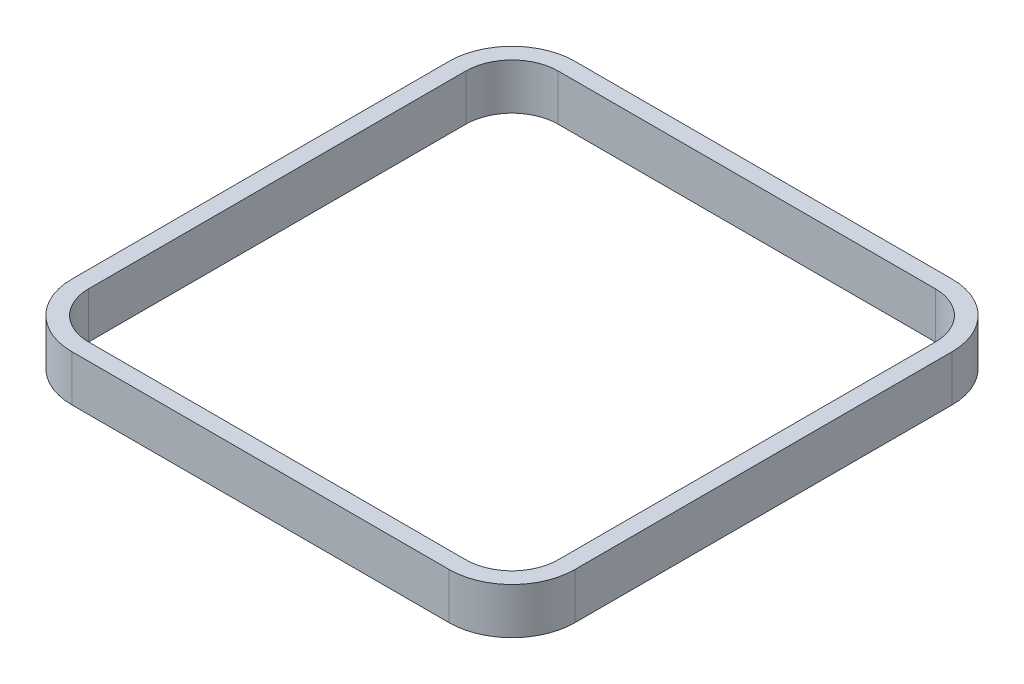
ISO-10303-21;
HEADER;
FILE_DESCRIPTION(('STEP AP214'),'2;1');
FILE_NAME('part.step','',(''),(''),'','','');
FILE_SCHEMA(('AUTOMOTIVE_DESIGN { 1 0 10303 214 1 1 1 1 }'));
ENDSEC;
DATA;
#1=APPLICATION_CONTEXT('core data for automotive mechanical design processes');
#2=APPLICATION_PROTOCOL_DEFINITION('international standard','automotive_design',2000,#1);
#3=PRODUCT_CONTEXT('',#1,'mechanical');
#4=PRODUCT('Part','Part','',(#3));
#5=PRODUCT_RELATED_PRODUCT_CATEGORY('part','',(#4));
#6=PRODUCT_DEFINITION_FORMATION('','',#4);
#7=PRODUCT_DEFINITION_CONTEXT('part definition',#1,'design');
#8=PRODUCT_DEFINITION('design','',#6,#7);
#9=PRODUCT_DEFINITION_SHAPE('','',#8);
#10=(LENGTH_UNIT() NAMED_UNIT(*) SI_UNIT(.MILLI.,.METRE.));
#11=(NAMED_UNIT(*) PLANE_ANGLE_UNIT() SI_UNIT($,.RADIAN.));
#12=(NAMED_UNIT(*) SI_UNIT($,.STERADIAN.) SOLID_ANGLE_UNIT());
#13=UNCERTAINTY_MEASURE_WITH_UNIT(LENGTH_MEASURE(1.E-05),#10,'distance_accuracy_value','');
#14=(GEOMETRIC_REPRESENTATION_CONTEXT(3) GLOBAL_UNCERTAINTY_ASSIGNED_CONTEXT((#13)) GLOBAL_UNIT_ASSIGNED_CONTEXT((#10,
#11,#12)) REPRESENTATION_CONTEXT('',''));
#15=CARTESIAN_POINT('',(0.,0.,0.));
#16=DIRECTION('',(0.,0.,1.));
#17=DIRECTION('',(1.,0.,0.));
#18=AXIS2_PLACEMENT_3D('',#15,#16,#17);
#19=CARTESIAN_POINT('',(450.,150.,-450.));
#20=DIRECTION('',(0.,-1.,0.));
#21=DIRECTION('',(0.,0.,-1.));
#22=AXIS2_PLACEMENT_3D('',#19,#20,#21);
#23=CYLINDRICAL_SURFACE('',#22,150.);
#24=CARTESIAN_POINT('',(450.,40.,-450.));
#25=DIRECTION('',(0.,-1.,0.));
#26=DIRECTION('',(0.,0.,-1.));
#27=AXIS2_PLACEMENT_3D('',#24,#25,#26);
#28=CIRCLE('',#27,150.);
#29=CARTESIAN_POINT('',(449.999999999999,40.,-600.));
#30=VERTEX_POINT('',#29);
#31=CARTESIAN_POINT('',(600.,40.,-449.999999999999));
#32=VERTEX_POINT('',#31);
#33=EDGE_CURVE('E51',#30,#32,#28,.T.);
#34=ORIENTED_EDGE('',*,*,#33,.F.);
#35=DIRECTION('',(0.,-1.,0.));
#36=VECTOR('',#35,1.);
#37=CARTESIAN_POINT('',(449.999999999999,150.,-600.));
#38=LINE('',#37,#36);
#39=CARTESIAN_POINT('',(449.999999999999,150.,-600.));
#40=VERTEX_POINT('',#39);
#41=EDGE_CURVE('E11',#40,#30,#38,.T.);
#42=ORIENTED_EDGE('',*,*,#41,.F.);
#43=CARTESIAN_POINT('',(450.,150.,-450.));
#44=DIRECTION('',(0.,1.,0.));
#45=DIRECTION('',(0.,0.,-1.));
#46=AXIS2_PLACEMENT_3D('',#43,#44,#45);
#47=CIRCLE('',#46,150.);
#48=CARTESIAN_POINT('',(600.,150.,-449.999999999999));
#49=VERTEX_POINT('',#48);
#50=EDGE_CURVE('E278',#49,#40,#47,.T.);
#51=ORIENTED_EDGE('',*,*,#50,.F.);
#52=DIRECTION('',(0.,-1.,0.));
#53=VECTOR('',#52,1.);
#54=CARTESIAN_POINT('',(600.,150.,-449.999999999999));
#55=LINE('',#54,#53);
#56=EDGE_CURVE('E174',#49,#32,#55,.T.);
#57=ORIENTED_EDGE('',*,*,#56,.T.);
#58=EDGE_LOOP('',(#34,#42,#51,#57));
#59=FACE_BOUND('',#58,.T.);
#60=ADVANCED_FACE('F36',(#59),#23,.T.);
#61=CARTESIAN_POINT('',(-449.999999999999,150.,-600.));
#62=DIRECTION('',(0.,0.,1.));
#63=DIRECTION('',(1.,0.,0.));
#64=AXIS2_PLACEMENT_3D('',#61,#62,#63);
#65=PLANE('',#64);
#66=DIRECTION('',(1.,0.,0.));
#67=VECTOR('',#66,1.);
#68=CARTESIAN_POINT('',(-449.999999999999,40.,-600.));
#69=LINE('',#68,#67);
#70=CARTESIAN_POINT('',(-449.999999999999,40.,-600.));
#71=VERTEX_POINT('',#70);
#72=EDGE_CURVE('E212',#71,#30,#69,.T.);
#73=ORIENTED_EDGE('',*,*,#72,.F.);
#74=DIRECTION('',(0.,-1.,0.));
#75=VECTOR('',#74,1.);
#76=CARTESIAN_POINT('',(-449.999999999999,150.,-600.));
#77=LINE('',#76,#75);
#78=CARTESIAN_POINT('',(-449.999999999999,150.,-600.));
#79=VERTEX_POINT('',#78);
#80=EDGE_CURVE('E44',#79,#71,#77,.T.);
#81=ORIENTED_EDGE('',*,*,#80,.F.);
#82=DIRECTION('',(-1.,0.,0.));
#83=VECTOR('',#82,1.);
#84=CARTESIAN_POINT('',(-449.999999999999,150.,-600.));
#85=LINE('',#84,#83);
#86=EDGE_CURVE('E210',#40,#79,#85,.T.);
#87=ORIENTED_EDGE('',*,*,#86,.F.);
#88=ORIENTED_EDGE('',*,*,#41,.T.);
#89=EDGE_LOOP('',(#73,#81,#87,#88));
#90=FACE_BOUND('',#89,.T.);
#91=ADVANCED_FACE('F209',(#90),#65,.F.);
#92=CARTESIAN_POINT('',(-450.,150.,-450.));
#93=DIRECTION('',(0.,-1.,0.));
#94=DIRECTION('',(0.,0.,-1.));
#95=AXIS2_PLACEMENT_3D('',#92,#93,#94);
#96=CYLINDRICAL_SURFACE('',#95,150.);
#97=CARTESIAN_POINT('',(-450.,40.,-450.));
#98=DIRECTION('',(0.,-1.,0.));
#99=DIRECTION('',(0.,0.,-1.));
#100=AXIS2_PLACEMENT_3D('',#97,#98,#99);
#101=CIRCLE('',#100,150.);
#102=CARTESIAN_POINT('',(-600.,40.,-449.999999999999));
#103=VERTEX_POINT('',#102);
#104=EDGE_CURVE('E205',#103,#71,#101,.T.);
#105=ORIENTED_EDGE('',*,*,#104,.F.);
#106=DIRECTION('',(0.,-1.,0.));
#107=VECTOR('',#106,1.);
#108=CARTESIAN_POINT('',(-600.,150.,-449.999999999999));
#109=LINE('',#108,#107);
#110=CARTESIAN_POINT('',(-600.,150.,-449.999999999999));
#111=VERTEX_POINT('',#110);
#112=EDGE_CURVE('E192',#111,#103,#109,.T.);
#113=ORIENTED_EDGE('',*,*,#112,.F.);
#114=CARTESIAN_POINT('',(-450.,150.,-450.));
#115=DIRECTION('',(0.,1.,0.));
#116=DIRECTION('',(0.,0.,-1.));
#117=AXIS2_PLACEMENT_3D('',#114,#115,#116);
#118=CIRCLE('',#117,150.);
#119=EDGE_CURVE('E206',#79,#111,#118,.T.);
#120=ORIENTED_EDGE('',*,*,#119,.F.);
#121=ORIENTED_EDGE('',*,*,#80,.T.);
#122=EDGE_LOOP('',(#105,#113,#120,#121));
#123=FACE_BOUND('',#122,.T.);
#124=ADVANCED_FACE('F203',(#123),#96,.T.);
#125=CARTESIAN_POINT('',(-600.,150.,449.999999999999));
#126=DIRECTION('',(1.,0.,0.));
#127=DIRECTION('',(0.,0.,-1.));
#128=AXIS2_PLACEMENT_3D('',#125,#126,#127);
#129=PLANE('',#128);
#130=DIRECTION('',(0.,0.,-1.));
#131=VECTOR('',#130,1.);
#132=CARTESIAN_POINT('',(-600.,40.,449.999999999999));
#133=LINE('',#132,#131);
#134=CARTESIAN_POINT('',(-600.,40.,449.999999999999));
#135=VERTEX_POINT('',#134);
#136=EDGE_CURVE('E221',#135,#103,#133,.T.);
#137=ORIENTED_EDGE('',*,*,#136,.F.);
#138=DIRECTION('',(0.,-1.,0.));
#139=VECTOR('',#138,1.);
#140=CARTESIAN_POINT('',(-600.,150.,449.999999999999));
#141=LINE('',#140,#139);
#142=CARTESIAN_POINT('',(-600.,150.,449.999999999999));
#143=VERTEX_POINT('',#142);
#144=EDGE_CURVE('E188',#143,#135,#141,.T.);
#145=ORIENTED_EDGE('',*,*,#144,.F.);
#146=DIRECTION('',(0.,0.,1.));
#147=VECTOR('',#146,1.);
#148=CARTESIAN_POINT('',(-600.,150.,449.999999999999));
#149=LINE('',#148,#147);
#150=EDGE_CURVE('E304',#111,#143,#149,.T.);
#151=ORIENTED_EDGE('',*,*,#150,.F.);
#152=ORIENTED_EDGE('',*,*,#112,.T.);
#153=EDGE_LOOP('',(#137,#145,#151,#152));
#154=FACE_BOUND('',#153,.T.);
#155=ADVANCED_FACE('F330',(#154),#129,.F.);
#156=CARTESIAN_POINT('',(-450.,150.,450.));
#157=DIRECTION('',(0.,-1.,0.));
#158=DIRECTION('',(0.,0.,-1.));
#159=AXIS2_PLACEMENT_3D('',#156,#157,#158);
#160=CYLINDRICAL_SURFACE('',#159,150.);
#161=CARTESIAN_POINT('',(-450.,40.,450.));
#162=DIRECTION('',(0.,-1.,0.));
#163=DIRECTION('',(0.,0.,-1.));
#164=AXIS2_PLACEMENT_3D('',#161,#162,#163);
#165=CIRCLE('',#164,150.);
#166=CARTESIAN_POINT('',(-449.999999999999,40.,600.));
#167=VERTEX_POINT('',#166);
#168=EDGE_CURVE('E323',#167,#135,#165,.T.);
#169=ORIENTED_EDGE('',*,*,#168,.F.);
#170=DIRECTION('',(0.,-1.,0.));
#171=VECTOR('',#170,1.);
#172=CARTESIAN_POINT('',(-449.999999999999,150.,600.));
#173=LINE('',#172,#171);
#174=CARTESIAN_POINT('',(-449.999999999999,150.,600.));
#175=VERTEX_POINT('',#174);
#176=EDGE_CURVE('E179',#175,#167,#173,.T.);
#177=ORIENTED_EDGE('',*,*,#176,.F.);
#178=CARTESIAN_POINT('',(-450.,150.,450.));
#179=DIRECTION('',(0.,1.,0.));
#180=DIRECTION('',(0.,0.,-1.));
#181=AXIS2_PLACEMENT_3D('',#178,#179,#180);
#182=CIRCLE('',#181,150.);
#183=EDGE_CURVE('E307',#143,#175,#182,.T.);
#184=ORIENTED_EDGE('',*,*,#183,.F.);
#185=ORIENTED_EDGE('',*,*,#144,.T.);
#186=EDGE_LOOP('',(#169,#177,#184,#185));
#187=FACE_BOUND('',#186,.T.);
#188=ADVANCED_FACE('F334',(#187),#160,.T.);
#189=CARTESIAN_POINT('',(-449.999999999999,150.,600.));
#190=DIRECTION('',(0.,0.,-1.));
#191=DIRECTION('',(-1.,0.,0.));
#192=AXIS2_PLACEMENT_3D('',#189,#190,#191);
#193=PLANE('',#192);
#194=DIRECTION('',(-1.,0.,0.));
#195=VECTOR('',#194,1.);
#196=CARTESIAN_POINT('',(449.999999999999,40.,600.));
#197=LINE('',#196,#195);
#198=CARTESIAN_POINT('',(449.999999999999,40.,600.));
#199=VERTEX_POINT('',#198);
#200=EDGE_CURVE('E169',#199,#167,#197,.T.);
#201=ORIENTED_EDGE('',*,*,#200,.F.);
#202=DIRECTION('',(0.,-1.,0.));
#203=VECTOR('',#202,1.);
#204=CARTESIAN_POINT('',(449.999999999999,150.,600.));
#205=LINE('',#204,#203);
#206=CARTESIAN_POINT('',(449.999999999999,150.,600.));
#207=VERTEX_POINT('',#206);
#208=EDGE_CURVE('E167',#207,#199,#205,.T.);
#209=ORIENTED_EDGE('',*,*,#208,.F.);
#210=DIRECTION('',(1.,0.,0.));
#211=VECTOR('',#210,1.);
#212=CARTESIAN_POINT('',(-449.999999999999,150.,600.));
#213=LINE('',#212,#211);
#214=EDGE_CURVE('E310',#175,#207,#213,.T.);
#215=ORIENTED_EDGE('',*,*,#214,.F.);
#216=ORIENTED_EDGE('',*,*,#176,.T.);
#217=EDGE_LOOP('',(#201,#209,#215,#216));
#218=FACE_BOUND('',#217,.T.);
#219=ADVANCED_FACE('F338',(#218),#193,.F.);
#220=CARTESIAN_POINT('',(450.,150.,450.));
#221=DIRECTION('',(0.,-1.,0.));
#222=DIRECTION('',(0.,0.,-1.));
#223=AXIS2_PLACEMENT_3D('',#220,#221,#222);
#224=CYLINDRICAL_SURFACE('',#223,150.);
#225=CARTESIAN_POINT('',(450.,40.,450.));
#226=DIRECTION('',(0.,-1.,0.));
#227=DIRECTION('',(0.,0.,-1.));
#228=AXIS2_PLACEMENT_3D('',#225,#226,#227);
#229=CIRCLE('',#228,150.);
#230=CARTESIAN_POINT('',(600.,40.,449.999999999999));
#231=VERTEX_POINT('',#230);
#232=EDGE_CURVE('E151',#231,#199,#229,.T.);
#233=ORIENTED_EDGE('',*,*,#232,.F.);
#234=DIRECTION('',(0.,-1.,0.));
#235=VECTOR('',#234,1.);
#236=CARTESIAN_POINT('',(600.,150.,449.999999999999));
#237=LINE('',#236,#235);
#238=CARTESIAN_POINT('',(600.,150.,449.999999999999));
#239=VERTEX_POINT('',#238);
#240=EDGE_CURVE('E164',#239,#231,#237,.T.);
#241=ORIENTED_EDGE('',*,*,#240,.F.);
#242=CARTESIAN_POINT('',(450.,150.,450.));
#243=DIRECTION('',(0.,1.,0.));
#244=DIRECTION('',(0.,0.,-1.));
#245=AXIS2_PLACEMENT_3D('',#242,#243,#244);
#246=CIRCLE('',#245,150.);
#247=EDGE_CURVE('E312',#207,#239,#246,.T.);
#248=ORIENTED_EDGE('',*,*,#247,.F.);
#249=ORIENTED_EDGE('',*,*,#208,.T.);
#250=EDGE_LOOP('',(#233,#241,#248,#249));
#251=FACE_BOUND('',#250,.T.);
#252=ADVANCED_FACE('F162',(#251),#224,.T.);
#253=CARTESIAN_POINT('',(600.,150.,449.999999999999));
#254=DIRECTION('',(-1.,0.,0.));
#255=DIRECTION('',(0.,0.,1.));
#256=AXIS2_PLACEMENT_3D('',#253,#254,#255);
#257=PLANE('',#256);
#258=DIRECTION('',(0.,0.,1.));
#259=VECTOR('',#258,1.);
#260=CARTESIAN_POINT('',(600.,40.,-449.999999999999));
#261=LINE('',#260,#259);
#262=EDGE_CURVE('E147',#32,#231,#261,.T.);
#263=ORIENTED_EDGE('',*,*,#262,.F.);
#264=ORIENTED_EDGE('',*,*,#56,.F.);
#265=DIRECTION('',(0.,0.,-1.));
#266=VECTOR('',#265,1.);
#267=CARTESIAN_POINT('',(600.,150.,449.999999999999));
#268=LINE('',#267,#266);
#269=EDGE_CURVE('E172',#239,#49,#268,.T.);
#270=ORIENTED_EDGE('',*,*,#269,.F.);
#271=ORIENTED_EDGE('',*,*,#240,.T.);
#272=EDGE_LOOP('',(#263,#264,#270,#271));
#273=FACE_BOUND('',#272,.T.);
#274=ADVANCED_FACE('F171',(#273),#257,.F.);
#275=CARTESIAN_POINT('',(450.,150.,-450.));
#276=DIRECTION('',(0.,-1.,0.));
#277=DIRECTION('',(0.,0.,-1.));
#278=AXIS2_PLACEMENT_3D('',#275,#276,#277);
#279=PLANE('',#278);
#280=DIRECTION('',(-1.,0.,0.));
#281=VECTOR('',#280,1.);
#282=CARTESIAN_POINT('',(449.999999999999,150.,-560.));
#283=LINE('',#282,#281);
#284=CARTESIAN_POINT('',(449.999999999999,150.,-560.));
#285=VERTEX_POINT('',#284);
#286=CARTESIAN_POINT('',(-449.999999999999,150.,-560.));
#287=VERTEX_POINT('',#286);
#288=EDGE_CURVE('E219',#285,#287,#283,.T.);
#289=ORIENTED_EDGE('',*,*,#288,.F.);
#290=CARTESIAN_POINT('',(450.,150.,-450.));
#291=DIRECTION('',(0.,1.,0.));
#292=DIRECTION('',(0.,0.,1.));
#293=AXIS2_PLACEMENT_3D('',#290,#291,#292);
#294=CIRCLE('',#293,110.);
#295=CARTESIAN_POINT('',(560.,150.,-449.999999999999));
#296=VERTEX_POINT('',#295);
#297=EDGE_CURVE('E59',#296,#285,#294,.T.);
#298=ORIENTED_EDGE('',*,*,#297,.F.);
#299=DIRECTION('',(0.,0.,-1.));
#300=VECTOR('',#299,1.);
#301=CARTESIAN_POINT('',(560.,150.,449.999999999999));
#302=LINE('',#301,#300);
#303=CARTESIAN_POINT('',(560.,150.,449.999999999999));
#304=VERTEX_POINT('',#303);
#305=EDGE_CURVE('E229',#304,#296,#302,.T.);
#306=ORIENTED_EDGE('',*,*,#305,.F.);
#307=CARTESIAN_POINT('',(450.,150.,450.));
#308=DIRECTION('',(0.,1.,0.));
#309=DIRECTION('',(0.,0.,1.));
#310=AXIS2_PLACEMENT_3D('',#307,#308,#309);
#311=CIRCLE('',#310,110.);
#312=CARTESIAN_POINT('',(449.999999999999,150.,560.));
#313=VERTEX_POINT('',#312);
#314=EDGE_CURVE('E268',#313,#304,#311,.T.);
#315=ORIENTED_EDGE('',*,*,#314,.F.);
#316=DIRECTION('',(1.,0.,0.));
#317=VECTOR('',#316,1.);
#318=CARTESIAN_POINT('',(-449.999999999999,150.,560.));
#319=LINE('',#318,#317);
#320=CARTESIAN_POINT('',(-449.999999999999,150.,560.));
#321=VERTEX_POINT('',#320);
#322=EDGE_CURVE('E264',#321,#313,#319,.T.);
#323=ORIENTED_EDGE('',*,*,#322,.F.);
#324=CARTESIAN_POINT('',(-450.,150.,450.));
#325=DIRECTION('',(0.,1.,0.));
#326=DIRECTION('',(0.,0.,1.));
#327=AXIS2_PLACEMENT_3D('',#324,#325,#326);
#328=CIRCLE('',#327,110.);
#329=CARTESIAN_POINT('',(-560.,150.,449.999999999999));
#330=VERTEX_POINT('',#329);
#331=EDGE_CURVE('E261',#330,#321,#328,.T.);
#332=ORIENTED_EDGE('',*,*,#331,.F.);
#333=DIRECTION('',(0.,0.,1.));
#334=VECTOR('',#333,1.);
#335=CARTESIAN_POINT('',(-560.,150.,-449.999999999999));
#336=LINE('',#335,#334);
#337=CARTESIAN_POINT('',(-560.,150.,-449.999999999999));
#338=VERTEX_POINT('',#337);
#339=EDGE_CURVE('E257',#338,#330,#336,.T.);
#340=ORIENTED_EDGE('',*,*,#339,.F.);
#341=CARTESIAN_POINT('',(-450.,150.,-450.));
#342=DIRECTION('',(0.,1.,0.));
#343=DIRECTION('',(0.,0.,1.));
#344=AXIS2_PLACEMENT_3D('',#341,#342,#343);
#345=CIRCLE('',#344,110.);
#346=EDGE_CURVE('E253',#287,#338,#345,.T.);
#347=ORIENTED_EDGE('',*,*,#346,.F.);
#348=EDGE_LOOP('',(#289,#298,#306,#315,#323,#332,#340,#347));
#349=FACE_BOUND('',#348,.T.);
#350=ORIENTED_EDGE('',*,*,#50,.T.);
#351=ORIENTED_EDGE('',*,*,#86,.T.);
#352=ORIENTED_EDGE('',*,*,#119,.T.);
#353=ORIENTED_EDGE('',*,*,#150,.T.);
#354=ORIENTED_EDGE('',*,*,#183,.T.);
#355=ORIENTED_EDGE('',*,*,#214,.T.);
#356=ORIENTED_EDGE('',*,*,#247,.T.);
#357=ORIENTED_EDGE('',*,*,#269,.T.);
#358=EDGE_LOOP('',(#350,#351,#352,#353,#354,#355,#356,#357));
#359=FACE_BOUND('',#358,.T.);
#360=ADVANCED_FACE('F315',(#349,#359),#279,.F.);
#361=CARTESIAN_POINT('',(450.,40.,-450.));
#362=DIRECTION('',(0.,1.,0.));
#363=DIRECTION('',(0.,0.,1.));
#364=AXIS2_PLACEMENT_3D('',#361,#362,#363);
#365=CYLINDRICAL_SURFACE('',#364,110.);
#366=ORIENTED_EDGE('',*,*,#297,.T.);
#367=DIRECTION('',(0.,1.,0.));
#368=VECTOR('',#367,1.);
#369=CARTESIAN_POINT('',(449.999999999999,40.,-560.));
#370=LINE('',#369,#368);
#371=CARTESIAN_POINT('',(449.999999999999,40.,-560.));
#372=VERTEX_POINT('',#371);
#373=EDGE_CURVE('E248',#372,#285,#370,.T.);
#374=ORIENTED_EDGE('',*,*,#373,.F.);
#375=CARTESIAN_POINT('',(450.,40.,-450.));
#376=DIRECTION('',(0.,1.,0.));
#377=DIRECTION('',(0.,0.,1.));
#378=AXIS2_PLACEMENT_3D('',#375,#376,#377);
#379=CIRCLE('',#378,110.);
#380=CARTESIAN_POINT('',(560.,40.,-449.999999999999));
#381=VERTEX_POINT('',#380);
#382=EDGE_CURVE('E225',#381,#372,#379,.T.);
#383=ORIENTED_EDGE('',*,*,#382,.F.);
#384=DIRECTION('',(0.,1.,0.));
#385=VECTOR('',#384,1.);
#386=CARTESIAN_POINT('',(560.,40.,-449.999999999999));
#387=LINE('',#386,#385);
#388=EDGE_CURVE('E275',#381,#296,#387,.T.);
#389=ORIENTED_EDGE('',*,*,#388,.T.);
#390=EDGE_LOOP('',(#366,#374,#383,#389));
#391=FACE_BOUND('',#390,.T.);
#392=ADVANCED_FACE('F387',(#391),#365,.F.);
#393=CARTESIAN_POINT('',(560.,40.,449.999999999999));
#394=DIRECTION('',(1.,0.,0.));
#395=DIRECTION('',(0.,0.,-1.));
#396=AXIS2_PLACEMENT_3D('',#393,#394,#395);
#397=PLANE('',#396);
#398=ORIENTED_EDGE('',*,*,#305,.T.);
#399=ORIENTED_EDGE('',*,*,#388,.F.);
#400=DIRECTION('',(0.,0.,-1.));
#401=VECTOR('',#400,1.);
#402=CARTESIAN_POINT('',(560.,40.,449.999999999999));
#403=LINE('',#402,#401);
#404=CARTESIAN_POINT('',(560.,40.,449.999999999999));
#405=VERTEX_POINT('',#404);
#406=EDGE_CURVE('E246',#405,#381,#403,.T.);
#407=ORIENTED_EDGE('',*,*,#406,.F.);
#408=DIRECTION('',(0.,1.,0.));
#409=VECTOR('',#408,1.);
#410=CARTESIAN_POINT('',(560.,40.,449.999999999999));
#411=LINE('',#410,#409);
#412=EDGE_CURVE('E279',#405,#304,#411,.T.);
#413=ORIENTED_EDGE('',*,*,#412,.T.);
#414=EDGE_LOOP('',(#398,#399,#407,#413));
#415=FACE_BOUND('',#414,.T.);
#416=ADVANCED_FACE('F396',(#415),#397,.F.);
#417=CARTESIAN_POINT('',(450.,40.,450.));
#418=DIRECTION('',(0.,1.,0.));
#419=DIRECTION('',(0.,0.,1.));
#420=AXIS2_PLACEMENT_3D('',#417,#418,#419);
#421=CYLINDRICAL_SURFACE('',#420,110.);
#422=ORIENTED_EDGE('',*,*,#314,.T.);
#423=ORIENTED_EDGE('',*,*,#412,.F.);
#424=CARTESIAN_POINT('',(450.,40.,450.));
#425=DIRECTION('',(0.,1.,0.));
#426=DIRECTION('',(0.,0.,1.));
#427=AXIS2_PLACEMENT_3D('',#424,#425,#426);
#428=CIRCLE('',#427,110.);
#429=CARTESIAN_POINT('',(449.999999999999,40.,560.));
#430=VERTEX_POINT('',#429);
#431=EDGE_CURVE('E244',#430,#405,#428,.T.);
#432=ORIENTED_EDGE('',*,*,#431,.F.);
#433=DIRECTION('',(0.,1.,0.));
#434=VECTOR('',#433,1.);
#435=CARTESIAN_POINT('',(449.999999999999,40.,560.));
#436=LINE('',#435,#434);
#437=EDGE_CURVE('E282',#430,#313,#436,.T.);
#438=ORIENTED_EDGE('',*,*,#437,.T.);
#439=EDGE_LOOP('',(#422,#423,#432,#438));
#440=FACE_BOUND('',#439,.T.);
#441=ADVANCED_FACE('F404',(#440),#421,.F.);
#442=CARTESIAN_POINT('',(-449.999999999999,40.,560.));
#443=DIRECTION('',(0.,0.,1.));
#444=DIRECTION('',(1.,0.,0.));
#445=AXIS2_PLACEMENT_3D('',#442,#443,#444);
#446=PLANE('',#445);
#447=ORIENTED_EDGE('',*,*,#322,.T.);
#448=ORIENTED_EDGE('',*,*,#437,.F.);
#449=DIRECTION('',(1.,0.,0.));
#450=VECTOR('',#449,1.);
#451=CARTESIAN_POINT('',(-449.999999999999,40.,560.));
#452=LINE('',#451,#450);
#453=CARTESIAN_POINT('',(-449.999999999999,40.,560.));
#454=VERTEX_POINT('',#453);
#455=EDGE_CURVE('E241',#454,#430,#452,.T.);
#456=ORIENTED_EDGE('',*,*,#455,.F.);
#457=DIRECTION('',(0.,1.,0.));
#458=VECTOR('',#457,1.);
#459=CARTESIAN_POINT('',(-449.999999999999,40.,560.));
#460=LINE('',#459,#458);
#461=EDGE_CURVE('E285',#454,#321,#460,.T.);
#462=ORIENTED_EDGE('',*,*,#461,.T.);
#463=EDGE_LOOP('',(#447,#448,#456,#462));
#464=FACE_BOUND('',#463,.T.);
#465=ADVANCED_FACE('F413',(#464),#446,.F.);
#466=CARTESIAN_POINT('',(-450.,40.,450.));
#467=DIRECTION('',(0.,1.,0.));
#468=DIRECTION('',(0.,0.,1.));
#469=AXIS2_PLACEMENT_3D('',#466,#467,#468);
#470=CYLINDRICAL_SURFACE('',#469,110.);
#471=ORIENTED_EDGE('',*,*,#331,.T.);
#472=ORIENTED_EDGE('',*,*,#461,.F.);
#473=CARTESIAN_POINT('',(-450.,40.,450.));
#474=DIRECTION('',(0.,1.,0.));
#475=DIRECTION('',(0.,0.,1.));
#476=AXIS2_PLACEMENT_3D('',#473,#474,#475);
#477=CIRCLE('',#476,110.);
#478=CARTESIAN_POINT('',(-560.,40.,449.999999999999));
#479=VERTEX_POINT('',#478);
#480=EDGE_CURVE('E238',#479,#454,#477,.T.);
#481=ORIENTED_EDGE('',*,*,#480,.F.);
#482=DIRECTION('',(0.,1.,0.));
#483=VECTOR('',#482,1.);
#484=CARTESIAN_POINT('',(-560.,40.,449.999999999999));
#485=LINE('',#484,#483);
#486=EDGE_CURVE('E288',#479,#330,#485,.T.);
#487=ORIENTED_EDGE('',*,*,#486,.T.);
#488=EDGE_LOOP('',(#471,#472,#481,#487));
#489=FACE_BOUND('',#488,.T.);
#490=ADVANCED_FACE('F422',(#489),#470,.F.);
#491=CARTESIAN_POINT('',(-560.,40.,-449.999999999999));
#492=DIRECTION('',(-1.,0.,0.));
#493=DIRECTION('',(0.,0.,1.));
#494=AXIS2_PLACEMENT_3D('',#491,#492,#493);
#495=PLANE('',#494);
#496=ORIENTED_EDGE('',*,*,#339,.T.);
#497=ORIENTED_EDGE('',*,*,#486,.F.);
#498=DIRECTION('',(0.,0.,1.));
#499=VECTOR('',#498,1.);
#500=CARTESIAN_POINT('',(-560.,40.,-449.999999999999));
#501=LINE('',#500,#499);
#502=CARTESIAN_POINT('',(-560.,40.,-449.999999999999));
#503=VERTEX_POINT('',#502);
#504=EDGE_CURVE('E235',#503,#479,#501,.T.);
#505=ORIENTED_EDGE('',*,*,#504,.F.);
#506=DIRECTION('',(0.,1.,0.));
#507=VECTOR('',#506,1.);
#508=CARTESIAN_POINT('',(-560.,40.,-449.999999999999));
#509=LINE('',#508,#507);
#510=EDGE_CURVE('E291',#503,#338,#509,.T.);
#511=ORIENTED_EDGE('',*,*,#510,.T.);
#512=EDGE_LOOP('',(#496,#497,#505,#511));
#513=FACE_BOUND('',#512,.T.);
#514=ADVANCED_FACE('F431',(#513),#495,.F.);
#515=CARTESIAN_POINT('',(-450.,40.,-450.));
#516=DIRECTION('',(0.,1.,0.));
#517=DIRECTION('',(0.,0.,1.));
#518=AXIS2_PLACEMENT_3D('',#515,#516,#517);
#519=CYLINDRICAL_SURFACE('',#518,110.);
#520=ORIENTED_EDGE('',*,*,#346,.T.);
#521=ORIENTED_EDGE('',*,*,#510,.F.);
#522=CARTESIAN_POINT('',(-450.,40.,-450.));
#523=DIRECTION('',(0.,1.,0.));
#524=DIRECTION('',(0.,0.,1.));
#525=AXIS2_PLACEMENT_3D('',#522,#523,#524);
#526=CIRCLE('',#525,110.);
#527=CARTESIAN_POINT('',(-449.999999999999,40.,-560.));
#528=VERTEX_POINT('',#527);
#529=EDGE_CURVE('E232',#528,#503,#526,.T.);
#530=ORIENTED_EDGE('',*,*,#529,.F.);
#531=DIRECTION('',(0.,1.,0.));
#532=VECTOR('',#531,1.);
#533=CARTESIAN_POINT('',(-449.999999999999,40.,-560.));
#534=LINE('',#533,#532);
#535=EDGE_CURVE('E293',#528,#287,#534,.T.);
#536=ORIENTED_EDGE('',*,*,#535,.T.);
#537=EDGE_LOOP('',(#520,#521,#530,#536));
#538=FACE_BOUND('',#537,.T.);
#539=ADVANCED_FACE('F440',(#538),#519,.F.);
#540=CARTESIAN_POINT('',(449.999999999999,40.,-560.));
#541=DIRECTION('',(0.,0.,-1.));
#542=DIRECTION('',(-1.,0.,0.));
#543=AXIS2_PLACEMENT_3D('',#540,#541,#542);
#544=PLANE('',#543);
#545=ORIENTED_EDGE('',*,*,#288,.T.);
#546=ORIENTED_EDGE('',*,*,#535,.F.);
#547=DIRECTION('',(-1.,0.,0.));
#548=VECTOR('',#547,1.);
#549=CARTESIAN_POINT('',(449.999999999999,40.,-560.));
#550=LINE('',#549,#548);
#551=EDGE_CURVE('E228',#372,#528,#550,.T.);
#552=ORIENTED_EDGE('',*,*,#551,.F.);
#553=ORIENTED_EDGE('',*,*,#373,.T.);
#554=EDGE_LOOP('',(#545,#546,#552,#553));
#555=FACE_BOUND('',#554,.T.);
#556=ADVANCED_FACE('F449',(#555),#544,.F.);
#557=CARTESIAN_POINT('',(450.,40.,-450.));
#558=DIRECTION('',(0.,-1.,0.));
#559=DIRECTION('',(0.,0.,-1.));
#560=AXIS2_PLACEMENT_3D('',#557,#558,#559);
#561=PLANE('',#560);
#562=ORIENTED_EDGE('',*,*,#33,.T.);
#563=ORIENTED_EDGE('',*,*,#262,.T.);
#564=ORIENTED_EDGE('',*,*,#232,.T.);
#565=ORIENTED_EDGE('',*,*,#200,.T.);
#566=ORIENTED_EDGE('',*,*,#168,.T.);
#567=ORIENTED_EDGE('',*,*,#136,.T.);
#568=ORIENTED_EDGE('',*,*,#104,.T.);
#569=ORIENTED_EDGE('',*,*,#72,.T.);
#570=EDGE_LOOP('',(#562,#563,#564,#565,#566,#567,#568,#569));
#571=FACE_BOUND('',#570,.T.);
#572=ORIENTED_EDGE('',*,*,#382,.T.);
#573=ORIENTED_EDGE('',*,*,#551,.T.);
#574=ORIENTED_EDGE('',*,*,#529,.T.);
#575=ORIENTED_EDGE('',*,*,#504,.T.);
#576=ORIENTED_EDGE('',*,*,#480,.T.);
#577=ORIENTED_EDGE('',*,*,#455,.T.);
#578=ORIENTED_EDGE('',*,*,#431,.T.);
#579=ORIENTED_EDGE('',*,*,#406,.T.);
#580=EDGE_LOOP('',(#572,#573,#574,#575,#576,#577,#578,#579));
#581=FACE_BOUND('',#580,.T.);
#582=ADVANCED_FACE('F149',(#571,#581),#561,.T.);
#583=CLOSED_SHELL('',(#60,#91,#124,#155,#188,#219,#252,#274,#360,#392,#416,#441,#465,#490,#514,
#539,#556,#582));
#584=MANIFOLD_SOLID_BREP('B2',#583);
#585=ADVANCED_BREP_SHAPE_REPRESENTATION('',(#18,#584),#14);
#586=SHAPE_DEFINITION_REPRESENTATION(#9,#585);
ENDSEC;
END-ISO-10303-21;
